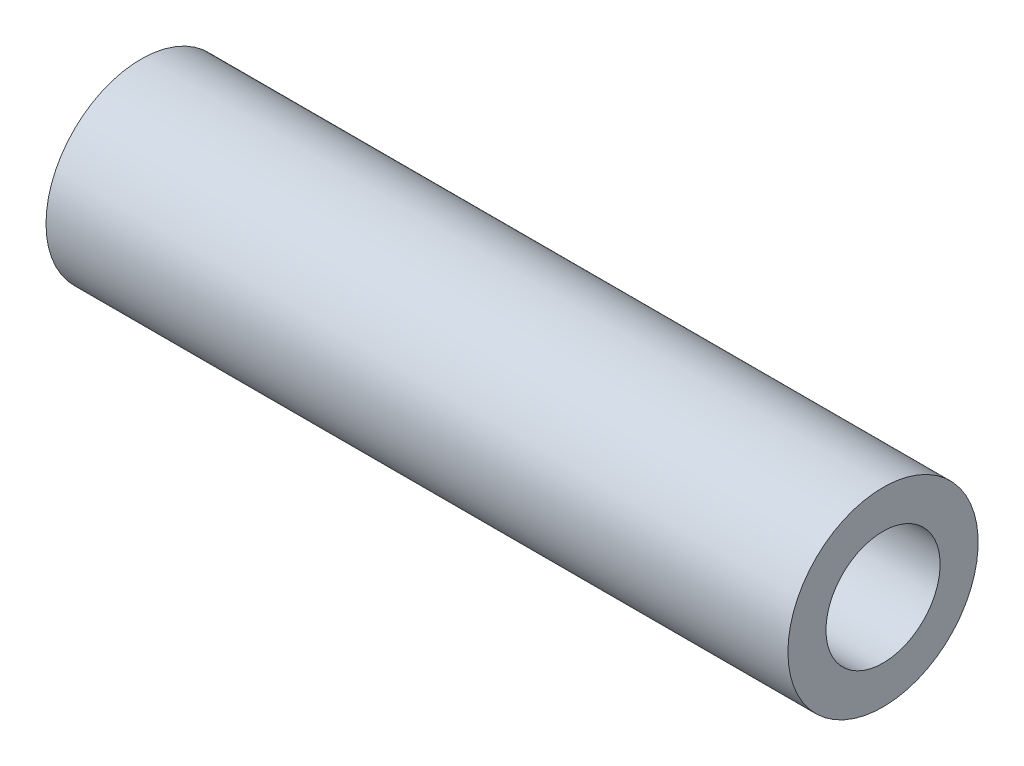
ISO-10303-21;
HEADER;
FILE_DESCRIPTION(('STEP AP214'),'2;1');
FILE_NAME('part.step','',(''),(''),'','','');
FILE_SCHEMA(('AUTOMOTIVE_DESIGN { 1 0 10303 214 1 1 1 1 }'));
ENDSEC;
DATA;
#1=APPLICATION_CONTEXT('core data for automotive mechanical design processes');
#2=APPLICATION_PROTOCOL_DEFINITION('international standard','automotive_design',2000,#1);
#3=PRODUCT_CONTEXT('',#1,'mechanical');
#4=PRODUCT('Part','Part','',(#3));
#5=PRODUCT_RELATED_PRODUCT_CATEGORY('part','',(#4));
#6=PRODUCT_DEFINITION_FORMATION('','',#4);
#7=PRODUCT_DEFINITION_CONTEXT('part definition',#1,'design');
#8=PRODUCT_DEFINITION('design','',#6,#7);
#9=PRODUCT_DEFINITION_SHAPE('','',#8);
#10=(LENGTH_UNIT() NAMED_UNIT(*) SI_UNIT(.MILLI.,.METRE.));
#11=(NAMED_UNIT(*) PLANE_ANGLE_UNIT() SI_UNIT($,.RADIAN.));
#12=(NAMED_UNIT(*) SI_UNIT($,.STERADIAN.) SOLID_ANGLE_UNIT());
#13=UNCERTAINTY_MEASURE_WITH_UNIT(LENGTH_MEASURE(1.E-05),#10,'distance_accuracy_value','');
#14=(GEOMETRIC_REPRESENTATION_CONTEXT(3) GLOBAL_UNCERTAINTY_ASSIGNED_CONTEXT((#13)) GLOBAL_UNIT_ASSIGNED_CONTEXT((#10,
#11,#12)) REPRESENTATION_CONTEXT('',''));
#15=CARTESIAN_POINT('',(0.,0.,0.));
#16=DIRECTION('',(0.,0.,1.));
#17=DIRECTION('',(1.,0.,0.));
#18=AXIS2_PLACEMENT_3D('',#15,#16,#17);
#19=CARTESIAN_POINT('',(0.,12.7,0.));
#20=DIRECTION('',(1.,0.,0.));
#21=DIRECTION('',(0.,0.,-1.));
#22=AXIS2_PLACEMENT_3D('',#19,#20,#21);
#23=PLANE('',#22);
#24=CARTESIAN_POINT('',(0.,0.,0.));
#25=DIRECTION('',(-1.,0.,0.));
#26=DIRECTION('',(0.,0.,1.));
#27=AXIS2_PLACEMENT_3D('',#24,#25,#26);
#28=CIRCLE('',#27,12.7);
#29=CARTESIAN_POINT('',(0.,0.,12.7));
#30=VERTEX_POINT('',#29);
#31=EDGE_CURVE('E49',#30,#30,#28,.T.);
#32=ORIENTED_EDGE('',*,*,#31,.F.);
#33=EDGE_LOOP('',(#32));
#34=FACE_BOUND('',#33,.T.);
#35=CARTESIAN_POINT('',(0.,0.,0.));
#36=DIRECTION('',(-1.,0.,0.));
#37=DIRECTION('',(0.,0.,1.));
#38=AXIS2_PLACEMENT_3D('',#35,#36,#37);
#39=CIRCLE('',#38,21.1666666666667);
#40=CARTESIAN_POINT('',(0.,0.,21.1666666666667));
#41=VERTEX_POINT('',#40);
#42=EDGE_CURVE('E10',#41,#41,#39,.T.);
#43=ORIENTED_EDGE('',*,*,#42,.T.);
#44=EDGE_LOOP('',(#43));
#45=FACE_BOUND('',#44,.T.);
#46=ADVANCED_FACE('F35',(#34,#45),#23,.F.);
#47=CARTESIAN_POINT('',(0.,0.,0.));
#48=DIRECTION('',(-1.,0.,0.));
#49=DIRECTION('',(0.,0.,1.));
#50=AXIS2_PLACEMENT_3D('',#47,#48,#49);
#51=CYLINDRICAL_SURFACE('',#50,21.1666666666667);
#52=ORIENTED_EDGE('',*,*,#42,.F.);
#53=EDGE_LOOP('',(#52));
#54=FACE_BOUND('',#53,.T.);
#55=CARTESIAN_POINT('',(165.1,0.,0.));
#56=DIRECTION('',(-1.,0.,0.));
#57=DIRECTION('',(0.,0.,1.));
#58=AXIS2_PLACEMENT_3D('',#55,#56,#57);
#59=CIRCLE('',#58,21.1666666666667);
#60=CARTESIAN_POINT('',(165.1,0.,21.1666666666667));
#61=VERTEX_POINT('',#60);
#62=EDGE_CURVE('E41',#61,#61,#59,.T.);
#63=ORIENTED_EDGE('',*,*,#62,.T.);
#64=EDGE_LOOP('',(#63));
#65=FACE_BOUND('',#64,.T.);
#66=ADVANCED_FACE('F58',(#54,#65),#51,.T.);
#67=CARTESIAN_POINT('',(165.1,12.7,0.));
#68=DIRECTION('',(-1.,0.,0.));
#69=DIRECTION('',(0.,0.,1.));
#70=AXIS2_PLACEMENT_3D('',#67,#68,#69);
#71=PLANE('',#70);
#72=ORIENTED_EDGE('',*,*,#62,.F.);
#73=EDGE_LOOP('',(#72));
#74=FACE_BOUND('',#73,.T.);
#75=CARTESIAN_POINT('',(165.1,0.,0.));
#76=DIRECTION('',(-1.,0.,0.));
#77=DIRECTION('',(0.,0.,1.));
#78=AXIS2_PLACEMENT_3D('',#75,#76,#77);
#79=CIRCLE('',#78,12.7);
#80=CARTESIAN_POINT('',(165.1,0.,12.7));
#81=VERTEX_POINT('',#80);
#82=EDGE_CURVE('E45',#81,#81,#79,.T.);
#83=ORIENTED_EDGE('',*,*,#82,.T.);
#84=EDGE_LOOP('',(#83));
#85=FACE_BOUND('',#84,.T.);
#86=ADVANCED_FACE('F62',(#74,#85),#71,.F.);
#87=CARTESIAN_POINT('',(0.,0.,0.));
#88=DIRECTION('',(-1.,0.,0.));
#89=DIRECTION('',(0.,0.,1.));
#90=AXIS2_PLACEMENT_3D('',#87,#88,#89);
#91=CYLINDRICAL_SURFACE('',#90,12.7);
#92=ORIENTED_EDGE('',*,*,#82,.F.);
#93=EDGE_LOOP('',(#92));
#94=FACE_BOUND('',#93,.T.);
#95=ORIENTED_EDGE('',*,*,#31,.T.);
#96=EDGE_LOOP('',(#95));
#97=FACE_BOUND('',#96,.T.);
#98=ADVANCED_FACE('F55',(#94,#97),#91,.F.);
#99=CLOSED_SHELL('',(#46,#66,#86,#98));
#100=MANIFOLD_SOLID_BREP('B2',#99);
#101=ADVANCED_BREP_SHAPE_REPRESENTATION('',(#18,#100),#14);
#102=SHAPE_DEFINITION_REPRESENTATION(#9,#101);
ENDSEC;
END-ISO-10303-21;
